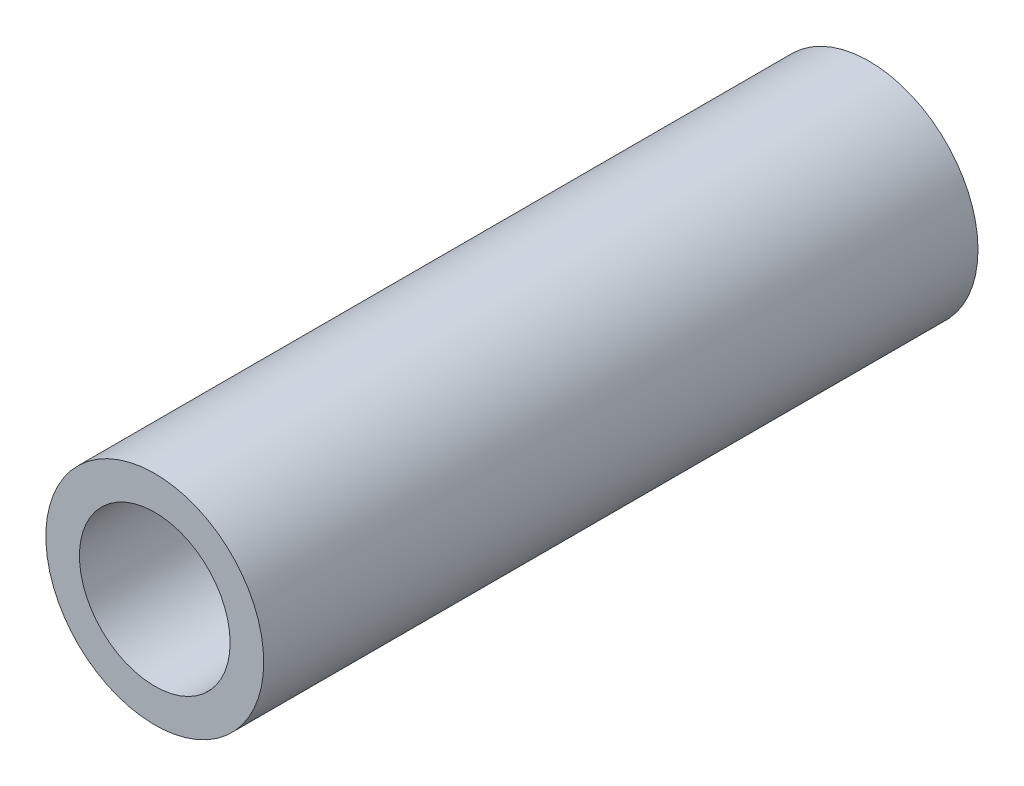
ISO-10303-21;
HEADER;
FILE_DESCRIPTION(('STEP AP214'),'2;1');
FILE_NAME('part.step','',(''),(''),'','','');
FILE_SCHEMA(('AUTOMOTIVE_DESIGN { 1 0 10303 214 1 1 1 1 }'));
ENDSEC;
DATA;
#1=APPLICATION_CONTEXT('core data for automotive mechanical design processes');
#2=APPLICATION_PROTOCOL_DEFINITION('international standard','automotive_design',2000,#1);
#3=PRODUCT_CONTEXT('',#1,'mechanical');
#4=PRODUCT('Part','Part','',(#3));
#5=PRODUCT_RELATED_PRODUCT_CATEGORY('part','',(#4));
#6=PRODUCT_DEFINITION_FORMATION('','',#4);
#7=PRODUCT_DEFINITION_CONTEXT('part definition',#1,'design');
#8=PRODUCT_DEFINITION('design','',#6,#7);
#9=PRODUCT_DEFINITION_SHAPE('','',#8);
#10=(LENGTH_UNIT() NAMED_UNIT(*) SI_UNIT(.MILLI.,.METRE.));
#11=(NAMED_UNIT(*) PLANE_ANGLE_UNIT() SI_UNIT($,.RADIAN.));
#12=(NAMED_UNIT(*) SI_UNIT($,.STERADIAN.) SOLID_ANGLE_UNIT());
#13=UNCERTAINTY_MEASURE_WITH_UNIT(LENGTH_MEASURE(1.E-05),#10,'distance_accuracy_value','');
#14=(GEOMETRIC_REPRESENTATION_CONTEXT(3) GLOBAL_UNCERTAINTY_ASSIGNED_CONTEXT((#13)) GLOBAL_UNIT_ASSIGNED_CONTEXT((#10,
#11,#12)) REPRESENTATION_CONTEXT('',''));
#15=CARTESIAN_POINT('',(0.,0.,0.));
#16=DIRECTION('',(0.,0.,1.));
#17=DIRECTION('',(1.,0.,0.));
#18=AXIS2_PLACEMENT_3D('',#15,#16,#17);
#19=CARTESIAN_POINT('',(0.,0.,50.8));
#20=DIRECTION('',(0.,0.,1.));
#21=DIRECTION('',(1.,0.,0.));
#22=AXIS2_PLACEMENT_3D('',#19,#20,#21);
#23=PLANE('',#22);
#24=CARTESIAN_POINT('',(0.,0.,50.8));
#25=DIRECTION('',(0.,0.,1.));
#26=DIRECTION('',(1.,0.,0.));
#27=AXIS2_PLACEMENT_3D('',#24,#25,#26);
#28=CIRCLE('',#27,7.747);
#29=CARTESIAN_POINT('',(7.747,0.,50.8));
#30=VERTEX_POINT('',#29);
#31=EDGE_CURVE('E10',#30,#30,#28,.T.);
#32=ORIENTED_EDGE('',*,*,#31,.T.);
#33=EDGE_LOOP('',(#32));
#34=FACE_BOUND('',#33,.T.);
#35=CARTESIAN_POINT('',(0.,0.,50.8));
#36=DIRECTION('',(0.,0.,1.));
#37=DIRECTION('',(1.,0.,0.));
#38=AXIS2_PLACEMENT_3D('',#35,#36,#37);
#39=CIRCLE('',#38,5.3594);
#40=CARTESIAN_POINT('',(5.3594,0.,50.8));
#41=VERTEX_POINT('',#40);
#42=EDGE_CURVE('E41',#41,#41,#39,.T.);
#43=ORIENTED_EDGE('',*,*,#42,.F.);
#44=EDGE_LOOP('',(#43));
#45=FACE_BOUND('',#44,.T.);
#46=ADVANCED_FACE('F30',(#34,#45),#23,.T.);
#47=CARTESIAN_POINT('',(0.,0.,0.));
#48=DIRECTION('',(0.,0.,1.));
#49=DIRECTION('',(1.,0.,0.));
#50=AXIS2_PLACEMENT_3D('',#47,#48,#49);
#51=PLANE('',#50);
#52=CARTESIAN_POINT('',(0.,0.,0.));
#53=DIRECTION('',(0.,0.,1.));
#54=DIRECTION('',(1.,0.,0.));
#55=AXIS2_PLACEMENT_3D('',#52,#53,#54);
#56=CIRCLE('',#55,7.747);
#57=CARTESIAN_POINT('',(7.747,0.,0.));
#58=VERTEX_POINT('',#57);
#59=EDGE_CURVE('E34',#58,#58,#56,.T.);
#60=ORIENTED_EDGE('',*,*,#59,.F.);
#61=EDGE_LOOP('',(#60));
#62=FACE_BOUND('',#61,.T.);
#63=CARTESIAN_POINT('',(0.,0.,0.));
#64=DIRECTION('',(0.,0.,1.));
#65=DIRECTION('',(1.,0.,0.));
#66=AXIS2_PLACEMENT_3D('',#63,#64,#65);
#67=CIRCLE('',#66,5.3594);
#68=CARTESIAN_POINT('',(5.3594,0.,0.));
#69=VERTEX_POINT('',#68);
#70=EDGE_CURVE('E43',#69,#69,#67,.T.);
#71=ORIENTED_EDGE('',*,*,#70,.T.);
#72=EDGE_LOOP('',(#71));
#73=FACE_BOUND('',#72,.T.);
#74=ADVANCED_FACE('F53',(#62,#73),#51,.F.);
#75=CARTESIAN_POINT('',(0.,0.,50.8));
#76=DIRECTION('',(0.,0.,-1.));
#77=DIRECTION('',(-1.,0.,0.));
#78=AXIS2_PLACEMENT_3D('',#75,#76,#77);
#79=CYLINDRICAL_SURFACE('',#78,7.747);
#80=ORIENTED_EDGE('',*,*,#31,.F.);
#81=EDGE_LOOP('',(#80));
#82=FACE_BOUND('',#81,.T.);
#83=ORIENTED_EDGE('',*,*,#59,.T.);
#84=EDGE_LOOP('',(#83));
#85=FACE_BOUND('',#84,.T.);
#86=ADVANCED_FACE('F32',(#82,#85),#79,.T.);
#87=CARTESIAN_POINT('',(0.,0.,50.8));
#88=DIRECTION('',(0.,0.,-1.));
#89=DIRECTION('',(-1.,0.,0.));
#90=AXIS2_PLACEMENT_3D('',#87,#88,#89);
#91=CYLINDRICAL_SURFACE('',#90,5.3594);
#92=ORIENTED_EDGE('',*,*,#42,.T.);
#93=EDGE_LOOP('',(#92));
#94=FACE_BOUND('',#93,.T.);
#95=ORIENTED_EDGE('',*,*,#70,.F.);
#96=EDGE_LOOP('',(#95));
#97=FACE_BOUND('',#96,.T.);
#98=ADVANCED_FACE('F49',(#94,#97),#91,.F.);
#99=CLOSED_SHELL('',(#46,#74,#86,#98));
#100=MANIFOLD_SOLID_BREP('B2',#99);
#101=ADVANCED_BREP_SHAPE_REPRESENTATION('',(#18,#100),#14);
#102=SHAPE_DEFINITION_REPRESENTATION(#9,#101);
ENDSEC;
END-ISO-10303-21;
